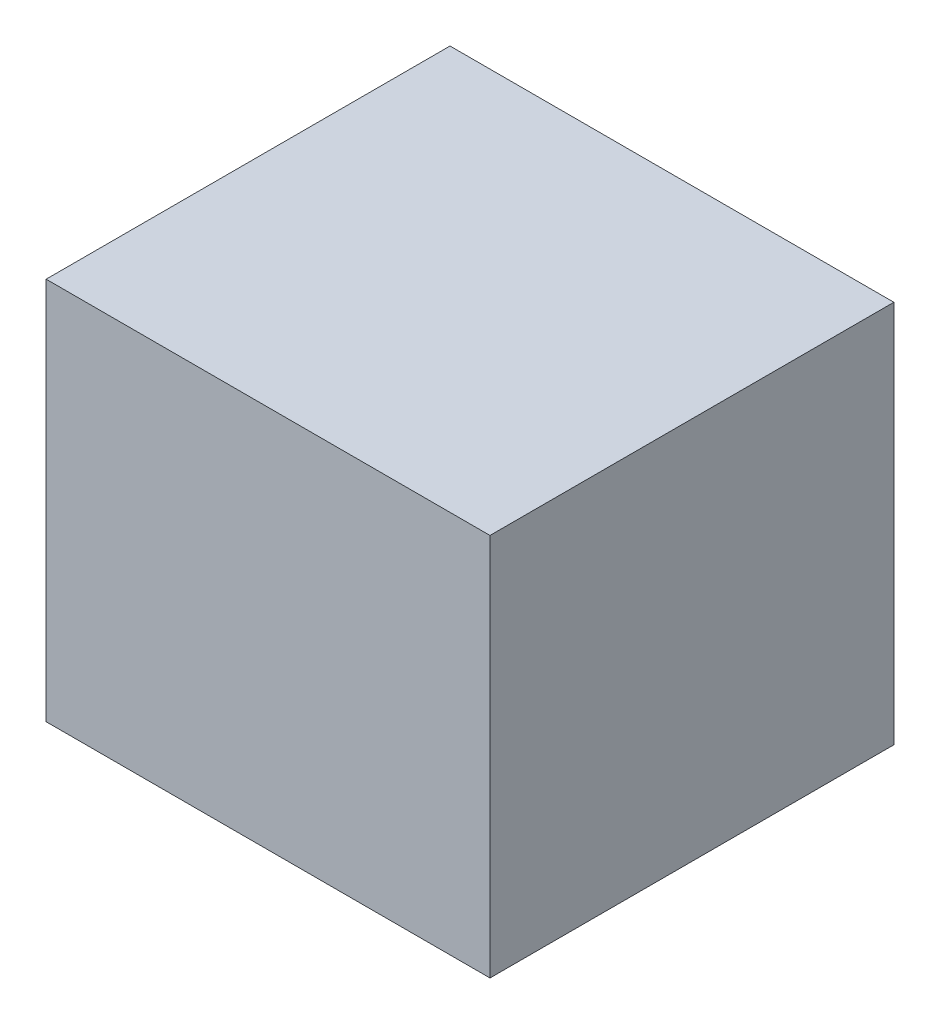
ISO-10303-21;
HEADER;
FILE_DESCRIPTION(('STEP AP214'),'2;1');
FILE_NAME('part.step','',(''),(''),'','','');
FILE_SCHEMA(('AUTOMOTIVE_DESIGN { 1 0 10303 214 1 1 1 1 }'));
ENDSEC;
DATA;
#1=APPLICATION_CONTEXT('core data for automotive mechanical design processes');
#2=APPLICATION_PROTOCOL_DEFINITION('international standard','automotive_design',2000,#1);
#3=PRODUCT_CONTEXT('',#1,'mechanical');
#4=PRODUCT('Part','Part','',(#3));
#5=PRODUCT_RELATED_PRODUCT_CATEGORY('part','',(#4));
#6=PRODUCT_DEFINITION_FORMATION('','',#4);
#7=PRODUCT_DEFINITION_CONTEXT('part definition',#1,'design');
#8=PRODUCT_DEFINITION('design','',#6,#7);
#9=PRODUCT_DEFINITION_SHAPE('','',#8);
#10=(LENGTH_UNIT() NAMED_UNIT(*) SI_UNIT(.MILLI.,.METRE.));
#11=(NAMED_UNIT(*) PLANE_ANGLE_UNIT() SI_UNIT($,.RADIAN.));
#12=(NAMED_UNIT(*) SI_UNIT($,.STERADIAN.) SOLID_ANGLE_UNIT());
#13=UNCERTAINTY_MEASURE_WITH_UNIT(LENGTH_MEASURE(1.E-05),#10,'distance_accuracy_value','');
#14=(GEOMETRIC_REPRESENTATION_CONTEXT(3) GLOBAL_UNCERTAINTY_ASSIGNED_CONTEXT((#13)) GLOBAL_UNIT_ASSIGNED_CONTEXT((#10,
#11,#12)) REPRESENTATION_CONTEXT('',''));
#15=CARTESIAN_POINT('',(0.,0.,0.));
#16=DIRECTION('',(0.,0.,1.));
#17=DIRECTION('',(1.,0.,0.));
#18=AXIS2_PLACEMENT_3D('',#15,#16,#17);
#19=CARTESIAN_POINT('',(-0.5494909,0.47449232,0.));
#20=DIRECTION('',(0.,1.,0.));
#21=DIRECTION('',(0.,0.,1.));
#22=AXIS2_PLACEMENT_3D('',#19,#20,#21);
#23=PLANE('',#22);
#24=DIRECTION('',(0.,0.,-1.));
#25=VECTOR('',#24,1.);
#26=CARTESIAN_POINT('',(0.5494909,0.47449232,0.));
#27=LINE('',#26,#25);
#28=CARTESIAN_POINT('',(0.5494909,0.47449232,0.));
#29=VERTEX_POINT('',#28);
#30=CARTESIAN_POINT('',(0.5494909,0.47449232,1.00000054));
#31=VERTEX_POINT('',#30);
#32=EDGE_CURVE('E20',#29,#31,#27,.F.);
#33=ORIENTED_EDGE('',*,*,#32,.F.);
#34=DIRECTION('',(-1.,0.,0.));
#35=VECTOR('',#34,1.);
#36=CARTESIAN_POINT('',(0.,0.47449232,0.));
#37=LINE('',#36,#35);
#38=CARTESIAN_POINT('',(-0.5494909,0.47449232,0.));
#39=VERTEX_POINT('',#38);
#40=EDGE_CURVE('E81',#39,#29,#37,.F.);
#41=ORIENTED_EDGE('',*,*,#40,.F.);
#42=DIRECTION('',(0.,0.,1.));
#43=VECTOR('',#42,1.);
#44=CARTESIAN_POINT('',(-0.5494909,0.47449232,0.));
#45=LINE('',#44,#43);
#46=CARTESIAN_POINT('',(-0.5494909,0.47449232,1.00000054));
#47=VERTEX_POINT('',#46);
#48=EDGE_CURVE('E68',#47,#39,#45,.F.);
#49=ORIENTED_EDGE('',*,*,#48,.F.);
#50=DIRECTION('',(-1.,0.,0.));
#51=VECTOR('',#50,1.);
#52=CARTESIAN_POINT('',(0.,0.47449232,1.00000054));
#53=LINE('',#52,#51);
#54=EDGE_CURVE('E55',#47,#31,#53,.F.);
#55=ORIENTED_EDGE('',*,*,#54,.T.);
#56=EDGE_LOOP('',(#33,#41,#49,#55));
#57=FACE_BOUND('',#56,.T.);
#58=ADVANCED_FACE('F17',(#57),#23,.T.);
#59=CARTESIAN_POINT('',(0.5494909,0.47449232,0.));
#60=DIRECTION('',(1.,0.,0.));
#61=DIRECTION('',(0.,0.,-1.));
#62=AXIS2_PLACEMENT_3D('',#59,#60,#61);
#63=PLANE('',#62);
#64=DIRECTION('',(0.,0.,-1.));
#65=VECTOR('',#64,1.);
#66=CARTESIAN_POINT('',(0.5494909,-0.47449232,0.));
#67=LINE('',#66,#65);
#68=CARTESIAN_POINT('',(0.5494909,-0.47449232,0.));
#69=VERTEX_POINT('',#68);
#70=CARTESIAN_POINT('',(0.5494909,-0.47449232,1.00000054));
#71=VERTEX_POINT('',#70);
#72=EDGE_CURVE('E83',#69,#71,#67,.F.);
#73=ORIENTED_EDGE('',*,*,#72,.F.);
#74=DIRECTION('',(0.,1.,0.));
#75=VECTOR('',#74,1.);
#76=CARTESIAN_POINT('',(0.5494909,0.,0.));
#77=LINE('',#76,#75);
#78=EDGE_CURVE('E64',#29,#69,#77,.F.);
#79=ORIENTED_EDGE('',*,*,#78,.F.);
#80=ORIENTED_EDGE('',*,*,#32,.T.);
#81=DIRECTION('',(0.,1.,0.));
#82=VECTOR('',#81,1.);
#83=CARTESIAN_POINT('',(0.5494909,0.,1.00000054));
#84=LINE('',#83,#82);
#85=EDGE_CURVE('E61',#31,#71,#84,.F.);
#86=ORIENTED_EDGE('',*,*,#85,.T.);
#87=EDGE_LOOP('',(#73,#79,#80,#86));
#88=FACE_BOUND('',#87,.T.);
#89=ADVANCED_FACE('F60',(#88),#63,.T.);
#90=CARTESIAN_POINT('',(0.,0.,1.00000054));
#91=DIRECTION('',(0.,0.,-1.));
#92=DIRECTION('',(-1.,0.,0.));
#93=AXIS2_PLACEMENT_3D('',#90,#91,#92);
#94=PLANE('',#93);
#95=DIRECTION('',(0.,1.,0.));
#96=VECTOR('',#95,1.);
#97=CARTESIAN_POINT('',(-0.5494909,-0.47449232,1.00000054));
#98=LINE('',#97,#96);
#99=CARTESIAN_POINT('',(-0.5494909,-0.47449232,1.00000054));
#100=VERTEX_POINT('',#99);
#101=EDGE_CURVE('E70',#100,#47,#98,.T.);
#102=ORIENTED_EDGE('',*,*,#101,.F.);
#103=DIRECTION('',(1.,0.,0.));
#104=VECTOR('',#103,1.);
#105=CARTESIAN_POINT('',(0.5494909,-0.47449232,1.00000054));
#106=LINE('',#105,#104);
#107=EDGE_CURVE('E74',#71,#100,#106,.F.);
#108=ORIENTED_EDGE('',*,*,#107,.F.);
#109=ORIENTED_EDGE('',*,*,#85,.F.);
#110=ORIENTED_EDGE('',*,*,#54,.F.);
#111=EDGE_LOOP('',(#102,#108,#109,#110));
#112=FACE_BOUND('',#111,.T.);
#113=ADVANCED_FACE('F72',(#112),#94,.F.);
#114=CARTESIAN_POINT('',(-0.5494909,-0.47449232,0.));
#115=DIRECTION('',(-1.,0.,0.));
#116=DIRECTION('',(0.,0.,1.));
#117=AXIS2_PLACEMENT_3D('',#114,#115,#116);
#118=PLANE('',#117);
#119=ORIENTED_EDGE('',*,*,#48,.T.);
#120=DIRECTION('',(0.,1.,0.));
#121=VECTOR('',#120,1.);
#122=CARTESIAN_POINT('',(-0.5494909,0.,0.));
#123=LINE('',#122,#121);
#124=CARTESIAN_POINT('',(-0.5494909,-0.47449232,0.));
#125=VERTEX_POINT('',#124);
#126=EDGE_CURVE('E35',#125,#39,#123,.T.);
#127=ORIENTED_EDGE('',*,*,#126,.F.);
#128=DIRECTION('',(0.,0.,-1.));
#129=VECTOR('',#128,1.);
#130=CARTESIAN_POINT('',(-0.5494909,-0.47449232,0.));
#131=LINE('',#130,#129);
#132=EDGE_CURVE('E26',#100,#125,#131,.T.);
#133=ORIENTED_EDGE('',*,*,#132,.F.);
#134=ORIENTED_EDGE('',*,*,#101,.T.);
#135=EDGE_LOOP('',(#119,#127,#133,#134));
#136=FACE_BOUND('',#135,.T.);
#137=ADVANCED_FACE('F89',(#136),#118,.T.);
#138=CARTESIAN_POINT('',(0.,0.,0.));
#139=DIRECTION('',(0.,0.,-1.));
#140=DIRECTION('',(-1.,0.,0.));
#141=AXIS2_PLACEMENT_3D('',#138,#139,#140);
#142=PLANE('',#141);
#143=ORIENTED_EDGE('',*,*,#126,.T.);
#144=ORIENTED_EDGE('',*,*,#40,.T.);
#145=ORIENTED_EDGE('',*,*,#78,.T.);
#146=DIRECTION('',(1.,0.,0.));
#147=VECTOR('',#146,1.);
#148=CARTESIAN_POINT('',(0.5494909,-0.47449232,0.));
#149=LINE('',#148,#147);
#150=EDGE_CURVE('E11',#125,#69,#149,.T.);
#151=ORIENTED_EDGE('',*,*,#150,.F.);
#152=EDGE_LOOP('',(#143,#144,#145,#151));
#153=FACE_BOUND('',#152,.T.);
#154=ADVANCED_FACE('F91',(#153),#142,.T.);
#155=CARTESIAN_POINT('',(0.5494909,-0.47449232,0.));
#156=DIRECTION('',(0.,-1.,0.));
#157=DIRECTION('',(0.,0.,-1.));
#158=AXIS2_PLACEMENT_3D('',#155,#156,#157);
#159=PLANE('',#158);
#160=ORIENTED_EDGE('',*,*,#132,.T.);
#161=ORIENTED_EDGE('',*,*,#150,.T.);
#162=ORIENTED_EDGE('',*,*,#72,.T.);
#163=ORIENTED_EDGE('',*,*,#107,.T.);
#164=EDGE_LOOP('',(#160,#161,#162,#163));
#165=FACE_BOUND('',#164,.T.);
#166=ADVANCED_FACE('F88',(#165),#159,.T.);
#167=CLOSED_SHELL('',(#58,#89,#113,#137,#154,#166));
#168=MANIFOLD_SOLID_BREP('B1',#167);
#169=ADVANCED_BREP_SHAPE_REPRESENTATION('',(#18,#168),#14);
#170=SHAPE_DEFINITION_REPRESENTATION(#9,#169);
ENDSEC;
END-ISO-10303-21;
